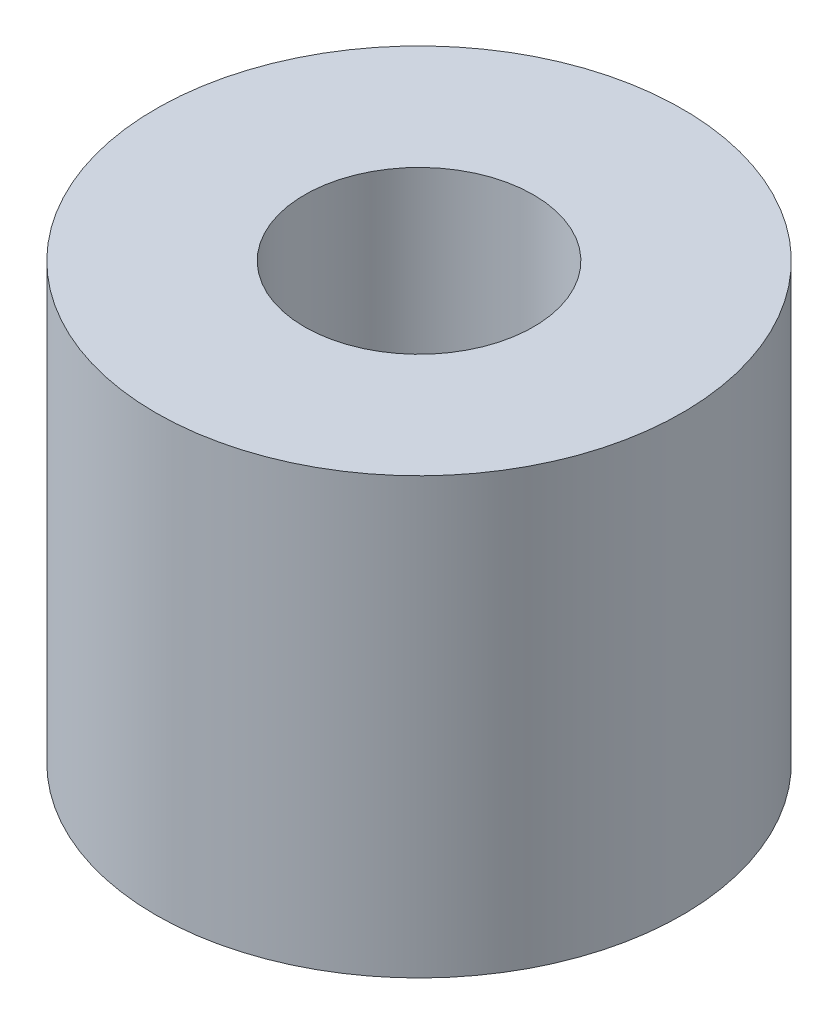
ISO-10303-21;
HEADER;
FILE_DESCRIPTION(('STEP AP214'),'2;1');
FILE_NAME('part.step','',(''),(''),'','','');
FILE_SCHEMA(('AUTOMOTIVE_DESIGN { 1 0 10303 214 1 1 1 1 }'));
ENDSEC;
DATA;
#1=APPLICATION_CONTEXT('core data for automotive mechanical design processes');
#2=APPLICATION_PROTOCOL_DEFINITION('international standard','automotive_design',2000,#1);
#3=PRODUCT_CONTEXT('',#1,'mechanical');
#4=PRODUCT('Part','Part','',(#3));
#5=PRODUCT_RELATED_PRODUCT_CATEGORY('part','',(#4));
#6=PRODUCT_DEFINITION_FORMATION('','',#4);
#7=PRODUCT_DEFINITION_CONTEXT('part definition',#1,'design');
#8=PRODUCT_DEFINITION('design','',#6,#7);
#9=PRODUCT_DEFINITION_SHAPE('','',#8);
#10=(LENGTH_UNIT() NAMED_UNIT(*) SI_UNIT(.MILLI.,.METRE.));
#11=(NAMED_UNIT(*) PLANE_ANGLE_UNIT() SI_UNIT($,.RADIAN.));
#12=(NAMED_UNIT(*) SI_UNIT($,.STERADIAN.) SOLID_ANGLE_UNIT());
#13=UNCERTAINTY_MEASURE_WITH_UNIT(LENGTH_MEASURE(1.E-05),#10,'distance_accuracy_value','');
#14=(GEOMETRIC_REPRESENTATION_CONTEXT(3) GLOBAL_UNCERTAINTY_ASSIGNED_CONTEXT((#13)) GLOBAL_UNIT_ASSIGNED_CONTEXT((#10,
#11,#12)) REPRESENTATION_CONTEXT('',''));
#15=CARTESIAN_POINT('',(0.,0.,0.));
#16=DIRECTION('',(0.,0.,1.));
#17=DIRECTION('',(1.,0.,0.));
#18=AXIS2_PLACEMENT_3D('',#15,#16,#17);
#19=CARTESIAN_POINT('',(0.,19.,0.));
#20=DIRECTION('',(0.,-1.,0.));
#21=DIRECTION('',(0.,0.,-1.));
#22=AXIS2_PLACEMENT_3D('',#19,#20,#21);
#23=CYLINDRICAL_SURFACE('',#22,11.5);
#24=CARTESIAN_POINT('',(0.,19.,0.));
#25=DIRECTION('',(0.,1.,0.));
#26=DIRECTION('',(0.,0.,1.));
#27=AXIS2_PLACEMENT_3D('',#24,#25,#26);
#28=CIRCLE('',#27,11.5);
#29=CARTESIAN_POINT('',(0.,19.,11.5));
#30=VERTEX_POINT('',#29);
#31=EDGE_CURVE('E10',#30,#30,#28,.T.);
#32=ORIENTED_EDGE('',*,*,#31,.F.);
#33=EDGE_LOOP('',(#32));
#34=FACE_BOUND('',#33,.T.);
#35=CARTESIAN_POINT('',(0.,0.,0.));
#36=DIRECTION('',(0.,1.,0.));
#37=DIRECTION('',(0.,0.,1.));
#38=AXIS2_PLACEMENT_3D('',#35,#36,#37);
#39=CIRCLE('',#38,11.5);
#40=CARTESIAN_POINT('',(0.,0.,11.5));
#41=VERTEX_POINT('',#40);
#42=EDGE_CURVE('E34',#41,#41,#39,.T.);
#43=ORIENTED_EDGE('',*,*,#42,.T.);
#44=EDGE_LOOP('',(#43));
#45=FACE_BOUND('',#44,.T.);
#46=ADVANCED_FACE('F31',(#34,#45),#23,.T.);
#47=CARTESIAN_POINT('',(0.,19.,0.));
#48=DIRECTION('',(0.,1.,0.));
#49=DIRECTION('',(0.,0.,1.));
#50=AXIS2_PLACEMENT_3D('',#47,#48,#49);
#51=PLANE('',#50);
#52=CARTESIAN_POINT('',(0.,19.,0.));
#53=DIRECTION('',(0.,1.,0.));
#54=DIRECTION('',(0.,0.,1.));
#55=AXIS2_PLACEMENT_3D('',#52,#53,#54);
#56=CIRCLE('',#55,5.);
#57=CARTESIAN_POINT('',(0.,19.,5.));
#58=VERTEX_POINT('',#57);
#59=EDGE_CURVE('E43',#58,#58,#56,.T.);
#60=ORIENTED_EDGE('',*,*,#59,.F.);
#61=EDGE_LOOP('',(#60));
#62=FACE_BOUND('',#61,.T.);
#63=ORIENTED_EDGE('',*,*,#31,.T.);
#64=EDGE_LOOP('',(#63));
#65=FACE_BOUND('',#64,.T.);
#66=ADVANCED_FACE('F58',(#62,#65),#51,.T.);
#67=CARTESIAN_POINT('',(0.,0.,0.));
#68=DIRECTION('',(0.,1.,0.));
#69=DIRECTION('',(0.,0.,1.));
#70=AXIS2_PLACEMENT_3D('',#67,#68,#69);
#71=PLANE('',#70);
#72=CARTESIAN_POINT('',(0.,0.,0.));
#73=DIRECTION('',(0.,1.,0.));
#74=DIRECTION('',(0.,0.,1.));
#75=AXIS2_PLACEMENT_3D('',#72,#73,#74);
#76=CIRCLE('',#75,5.);
#77=CARTESIAN_POINT('',(0.,0.,5.));
#78=VERTEX_POINT('',#77);
#79=EDGE_CURVE('E41',#78,#78,#76,.T.);
#80=ORIENTED_EDGE('',*,*,#79,.T.);
#81=EDGE_LOOP('',(#80));
#82=FACE_BOUND('',#81,.T.);
#83=ORIENTED_EDGE('',*,*,#42,.F.);
#84=EDGE_LOOP('',(#83));
#85=FACE_BOUND('',#84,.T.);
#86=ADVANCED_FACE('F49',(#82,#85),#71,.F.);
#87=CARTESIAN_POINT('',(0.,0.,0.));
#88=DIRECTION('',(0.,1.,0.));
#89=DIRECTION('',(0.,0.,1.));
#90=AXIS2_PLACEMENT_3D('',#87,#88,#89);
#91=CYLINDRICAL_SURFACE('',#90,5.);
#92=ORIENTED_EDGE('',*,*,#79,.F.);
#93=EDGE_LOOP('',(#92));
#94=FACE_BOUND('',#93,.T.);
#95=ORIENTED_EDGE('',*,*,#59,.T.);
#96=EDGE_LOOP('',(#95));
#97=FACE_BOUND('',#96,.T.);
#98=ADVANCED_FACE('F52',(#94,#97),#91,.F.);
#99=CLOSED_SHELL('',(#46,#66,#86,#98));
#100=MANIFOLD_SOLID_BREP('B2',#99);
#101=ADVANCED_BREP_SHAPE_REPRESENTATION('',(#18,#100),#14);
#102=SHAPE_DEFINITION_REPRESENTATION(#9,#101);
ENDSEC;
END-ISO-10303-21;
